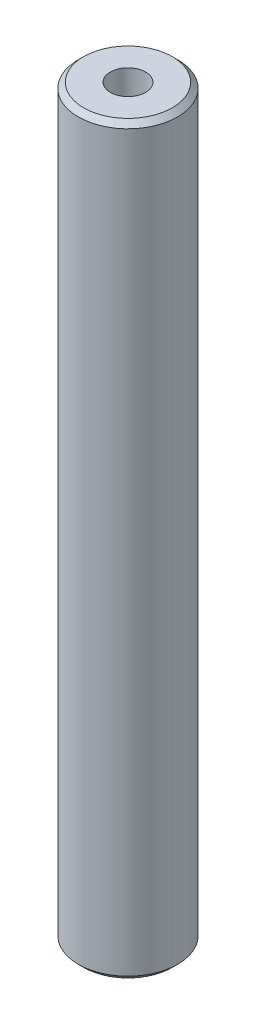
ISO-10303-21;
HEADER;
FILE_DESCRIPTION(('STEP AP214'),'2;1');
FILE_NAME('part.step','',(''),(''),'','','');
FILE_SCHEMA(('AUTOMOTIVE_DESIGN { 1 0 10303 214 1 1 1 1 }'));
ENDSEC;
DATA;
#1=APPLICATION_CONTEXT('core data for automotive mechanical design processes');
#2=APPLICATION_PROTOCOL_DEFINITION('international standard','automotive_design',2000,#1);
#3=PRODUCT_CONTEXT('',#1,'mechanical');
#4=PRODUCT('Part','Part','',(#3));
#5=PRODUCT_RELATED_PRODUCT_CATEGORY('part','',(#4));
#6=PRODUCT_DEFINITION_FORMATION('','',#4);
#7=PRODUCT_DEFINITION_CONTEXT('part definition',#1,'design');
#8=PRODUCT_DEFINITION('design','',#6,#7);
#9=PRODUCT_DEFINITION_SHAPE('','',#8);
#10=(LENGTH_UNIT() NAMED_UNIT(*) SI_UNIT(.MILLI.,.METRE.));
#11=(NAMED_UNIT(*) PLANE_ANGLE_UNIT() SI_UNIT($,.RADIAN.));
#12=(NAMED_UNIT(*) SI_UNIT($,.STERADIAN.) SOLID_ANGLE_UNIT());
#13=UNCERTAINTY_MEASURE_WITH_UNIT(LENGTH_MEASURE(1.E-05),#10,'distance_accuracy_value','');
#14=(GEOMETRIC_REPRESENTATION_CONTEXT(3) GLOBAL_UNCERTAINTY_ASSIGNED_CONTEXT((#13)) GLOBAL_UNIT_ASSIGNED_CONTEXT((#10,
#11,#12)) REPRESENTATION_CONTEXT('',''));
#15=CARTESIAN_POINT('',(0.,0.,0.));
#16=DIRECTION('',(0.,0.,1.));
#17=DIRECTION('',(1.,0.,0.));
#18=AXIS2_PLACEMENT_3D('',#15,#16,#17);
#19=CARTESIAN_POINT('',(0.,600.,0.));
#20=DIRECTION('',(0.,-1.,0.));
#21=DIRECTION('',(0.,0.,-1.));
#22=AXIS2_PLACEMENT_3D('',#19,#20,#21);
#23=CYLINDRICAL_SURFACE('',#22,40.);
#24=CARTESIAN_POINT('',(0.,595.741544627141,0.));
#25=DIRECTION('',(0.,1.,0.));
#26=DIRECTION('',(0.,0.,1.));
#27=AXIS2_PLACEMENT_3D('',#24,#25,#26);
#28=CIRCLE('',#27,40.);
#29=CARTESIAN_POINT('',(0.,595.741544627141,40.));
#30=VERTEX_POINT('',#29);
#31=EDGE_CURVE('E50',#30,#30,#28,.F.);
#32=ORIENTED_EDGE('',*,*,#31,.T.);
#33=EDGE_LOOP('',(#32));
#34=FACE_BOUND('',#33,.T.);
#35=CARTESIAN_POINT('',(0.,4.26196623210451,0.));
#36=DIRECTION('',(0.,1.,0.));
#37=DIRECTION('',(0.,0.,1.));
#38=AXIS2_PLACEMENT_3D('',#35,#36,#37);
#39=CIRCLE('',#38,40.);
#40=CARTESIAN_POINT('',(0.,4.26196623210451,40.));
#41=VERTEX_POINT('',#40);
#42=EDGE_CURVE('E51',#41,#41,#39,.T.);
#43=ORIENTED_EDGE('',*,*,#42,.T.);
#44=EDGE_LOOP('',(#43));
#45=FACE_BOUND('',#44,.T.);
#46=ADVANCED_FACE('F39',(#34,#45),#23,.T.);
#47=CARTESIAN_POINT('',(0.,600.,0.));
#48=DIRECTION('',(0.,1.,0.));
#49=DIRECTION('',(0.,0.,1.));
#50=AXIS2_PLACEMENT_3D('',#47,#48,#49);
#51=PLANE('',#50);
#52=CARTESIAN_POINT('',(0.,600.,0.));
#53=DIRECTION('',(0.,1.,0.));
#54=DIRECTION('',(0.,0.,1.));
#55=AXIS2_PLACEMENT_3D('',#52,#53,#54);
#56=CIRCLE('',#55,35.7380337678953);
#57=CARTESIAN_POINT('',(0.,600.,35.7380337678953));
#58=VERTEX_POINT('',#57);
#59=EDGE_CURVE('E54',#58,#58,#56,.T.);
#60=ORIENTED_EDGE('',*,*,#59,.T.);
#61=EDGE_LOOP('',(#60));
#62=FACE_BOUND('',#61,.T.);
#63=CARTESIAN_POINT('',(0.,600.,0.));
#64=DIRECTION('',(0.,1.,0.));
#65=DIRECTION('',(0.,0.,1.));
#66=AXIS2_PLACEMENT_3D('',#63,#64,#65);
#67=CIRCLE('',#66,14.2352634063833);
#68=CARTESIAN_POINT('',(0.,600.,14.2352634063833));
#69=VERTEX_POINT('',#68);
#70=EDGE_CURVE('E58',#69,#69,#67,.T.);
#71=ORIENTED_EDGE('',*,*,#70,.F.);
#72=EDGE_LOOP('',(#71));
#73=FACE_BOUND('',#72,.T.);
#74=ADVANCED_FACE('F69',(#62,#73),#51,.T.);
#75=CARTESIAN_POINT('',(0.,0.,0.));
#76=DIRECTION('',(0.,1.,0.));
#77=DIRECTION('',(0.,0.,1.));
#78=AXIS2_PLACEMENT_3D('',#75,#76,#77);
#79=PLANE('',#78);
#80=CARTESIAN_POINT('',(0.,0.,0.));
#81=DIRECTION('',(0.,1.,0.));
#82=DIRECTION('',(0.,0.,1.));
#83=AXIS2_PLACEMENT_3D('',#80,#81,#82);
#84=CIRCLE('',#83,35.741544627141);
#85=CARTESIAN_POINT('',(0.,0.,35.741544627141));
#86=VERTEX_POINT('',#85);
#87=EDGE_CURVE('E10',#86,#86,#84,.F.);
#88=ORIENTED_EDGE('',*,*,#87,.T.);
#89=EDGE_LOOP('',(#88));
#90=FACE_BOUND('',#89,.T.);
#91=CARTESIAN_POINT('',(0.,0.,0.));
#92=DIRECTION('',(0.,1.,0.));
#93=DIRECTION('',(0.,0.,1.));
#94=AXIS2_PLACEMENT_3D('',#91,#92,#93);
#95=CIRCLE('',#94,14.2352634063833);
#96=CARTESIAN_POINT('',(0.,0.,14.2352634063833));
#97=VERTEX_POINT('',#96);
#98=EDGE_CURVE('E63',#97,#97,#95,.T.);
#99=ORIENTED_EDGE('',*,*,#98,.T.);
#100=EDGE_LOOP('',(#99));
#101=FACE_BOUND('',#100,.T.);
#102=ADVANCED_FACE('F75',(#90,#101),#79,.F.);
#103=CARTESIAN_POINT('',(0.,600.,0.));
#104=DIRECTION('',(0.,-1.,0.));
#105=DIRECTION('',(0.,0.,-1.));
#106=AXIS2_PLACEMENT_3D('',#103,#104,#105);
#107=CYLINDRICAL_SURFACE('',#106,14.2352634063833);
#108=ORIENTED_EDGE('',*,*,#70,.T.);
#109=EDGE_LOOP('',(#108));
#110=FACE_BOUND('',#109,.T.);
#111=ORIENTED_EDGE('',*,*,#98,.F.);
#112=EDGE_LOOP('',(#111));
#113=FACE_BOUND('',#112,.T.);
#114=ADVANCED_FACE('F70',(#110,#113),#107,.F.);
#115=CARTESIAN_POINT('',(0.,600.,0.));
#116=DIRECTION('',(0.,-1.,0.));
#117=DIRECTION('',(0.,0.,-1.));
#118=AXIS2_PLACEMENT_3D('',#115,#116,#117);
#119=CONICAL_SURFACE('',#118,35.7380337678953,0.785810215665462);
#120=ORIENTED_EDGE('',*,*,#31,.F.);
#121=EDGE_LOOP('',(#120));
#122=FACE_BOUND('',#121,.T.);
#123=ORIENTED_EDGE('',*,*,#59,.F.);
#124=EDGE_LOOP('',(#123));
#125=FACE_BOUND('',#124,.T.);
#126=ADVANCED_FACE('F81',(#122,#125),#119,.T.);
#127=CARTESIAN_POINT('',(0.,4.26196623210451,0.));
#128=DIRECTION('',(0.,1.,0.));
#129=DIRECTION('',(0.,0.,1.));
#130=AXIS2_PLACEMENT_3D('',#127,#128,#129);
#131=CONICAL_SURFACE('',#130,40.,0.784986111129433);
#132=ORIENTED_EDGE('',*,*,#87,.F.);
#133=EDGE_LOOP('',(#132));
#134=FACE_BOUND('',#133,.T.);
#135=ORIENTED_EDGE('',*,*,#42,.F.);
#136=EDGE_LOOP('',(#135));
#137=FACE_BOUND('',#136,.T.);
#138=ADVANCED_FACE('F45',(#134,#137),#131,.T.);
#139=CLOSED_SHELL('',(#46,#74,#102,#114,#126,#138));
#140=MANIFOLD_SOLID_BREP('B2',#139);
#141=ADVANCED_BREP_SHAPE_REPRESENTATION('',(#18,#140),#14);
#142=SHAPE_DEFINITION_REPRESENTATION(#9,#141);
ENDSEC;
END-ISO-10303-21;
